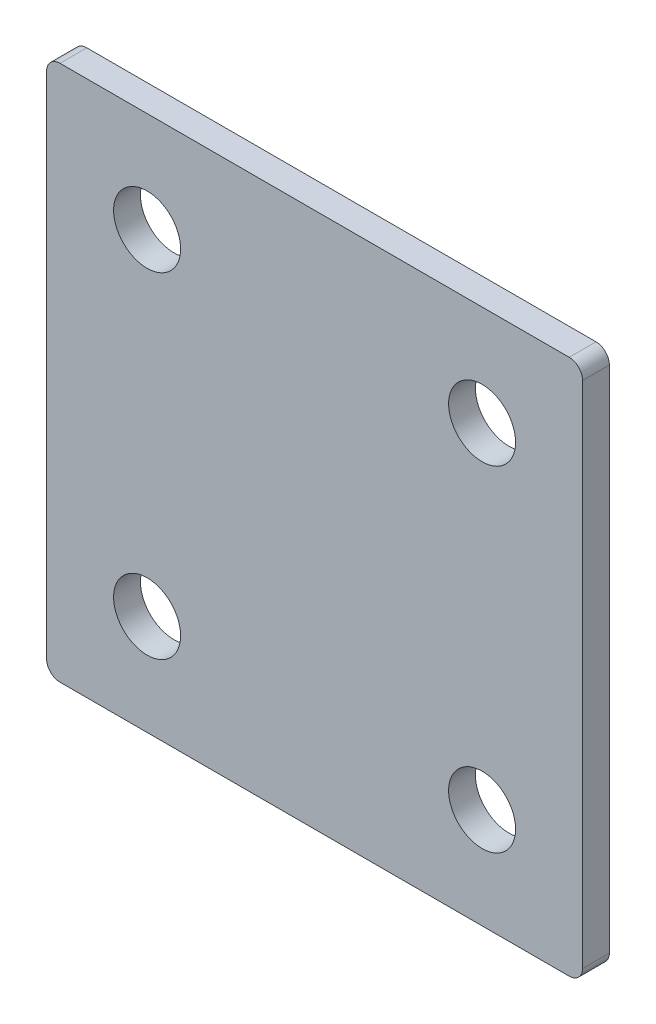
ISO-10303-21;
HEADER;
FILE_DESCRIPTION(('STEP AP214'),'2;1');
FILE_NAME('part.step','',(''),(''),'','','');
FILE_SCHEMA(('AUTOMOTIVE_DESIGN { 1 0 10303 214 1 1 1 1 }'));
ENDSEC;
DATA;
#1=APPLICATION_CONTEXT('core data for automotive mechanical design processes');
#2=APPLICATION_PROTOCOL_DEFINITION('international standard','automotive_design',2000,#1);
#3=PRODUCT_CONTEXT('',#1,'mechanical');
#4=PRODUCT('Part','Part','',(#3));
#5=PRODUCT_RELATED_PRODUCT_CATEGORY('part','',(#4));
#6=PRODUCT_DEFINITION_FORMATION('','',#4);
#7=PRODUCT_DEFINITION_CONTEXT('part definition',#1,'design');
#8=PRODUCT_DEFINITION('design','',#6,#7);
#9=PRODUCT_DEFINITION_SHAPE('','',#8);
#10=(LENGTH_UNIT() NAMED_UNIT(*) SI_UNIT(.MILLI.,.METRE.));
#11=(NAMED_UNIT(*) PLANE_ANGLE_UNIT() SI_UNIT($,.RADIAN.));
#12=(NAMED_UNIT(*) SI_UNIT($,.STERADIAN.) SOLID_ANGLE_UNIT());
#13=UNCERTAINTY_MEASURE_WITH_UNIT(LENGTH_MEASURE(1.E-05),#10,'distance_accuracy_value','');
#14=(GEOMETRIC_REPRESENTATION_CONTEXT(3) GLOBAL_UNCERTAINTY_ASSIGNED_CONTEXT((#13)) GLOBAL_UNIT_ASSIGNED_CONTEXT((#10,
#11,#12)) REPRESENTATION_CONTEXT('',''));
#15=CARTESIAN_POINT('',(0.,0.,0.));
#16=DIRECTION('',(0.,0.,1.));
#17=DIRECTION('',(1.,0.,0.));
#18=AXIS2_PLACEMENT_3D('',#15,#16,#17);
#19=CARTESIAN_POINT('',(515.343959720602,65.967618835388,16.7000000000001));
#20=DIRECTION('',(0.,0.,1.));
#21=DIRECTION('',(1.,0.,0.));
#22=AXIS2_PLACEMENT_3D('',#19,#20,#21);
#23=PLANE('',#22);
#24=CARTESIAN_POINT('',(578.343959753745,52.9676189960011,16.7000000000001));
#25=DIRECTION('',(0.,0.,1.));
#26=DIRECTION('',(1.,0.,0.));
#27=AXIS2_PLACEMENT_3D('',#24,#25,#26);
#28=CIRCLE('',#27,5.00000000000005);
#29=CARTESIAN_POINT('',(583.343959753745,52.9676189960011,16.7000000000001));
#30=VERTEX_POINT('',#29);
#31=EDGE_CURVE('E189',#30,#30,#28,.T.);
#32=ORIENTED_EDGE('',*,*,#31,.F.);
#33=EDGE_LOOP('',(#32));
#34=FACE_BOUND('',#33,.T.);
#35=CARTESIAN_POINT('',(528.343959881215,2.9676188685305,16.7000000000001));
#36=DIRECTION('',(0.,0.,1.));
#37=DIRECTION('',(1.,0.,0.));
#38=AXIS2_PLACEMENT_3D('',#35,#36,#37);
#39=CIRCLE('',#38,5.00000000000005);
#40=CARTESIAN_POINT('',(533.343959881215,2.9676188685305,16.7000000000001));
#41=VERTEX_POINT('',#40);
#42=EDGE_CURVE('E135',#41,#41,#39,.T.);
#43=ORIENTED_EDGE('',*,*,#42,.F.);
#44=EDGE_LOOP('',(#43));
#45=FACE_BOUND('',#44,.T.);
#46=CARTESIAN_POINT('',(515.343959720602,65.967618835388,16.7000000000001));
#47=DIRECTION('',(0.,0.,1.));
#48=DIRECTION('',(1.,0.,0.));
#49=AXIS2_PLACEMENT_3D('',#46,#47,#48);
#50=CIRCLE('',#49,2.);
#51=CARTESIAN_POINT('',(515.343959715504,67.967618835388,16.7000000000001));
#52=VERTEX_POINT('',#51);
#53=CARTESIAN_POINT('',(513.343959720602,65.9676188302892,16.7000000000001));
#54=VERTEX_POINT('',#53);
#55=EDGE_CURVE('E146',#52,#54,#50,.T.);
#56=ORIENTED_EDGE('',*,*,#55,.T.);
#57=DIRECTION('',(2.54941389636536E-09,-1.,0.));
#58=VECTOR('',#57,1.);
#59=CARTESIAN_POINT('',(513.343959720602,65.9676188302892,16.7000000000001));
#60=LINE('',#59,#58);
#61=CARTESIAN_POINT('',(513.343959914358,-10.0323811697108,16.7000000000001));
#62=VERTEX_POINT('',#61);
#63=EDGE_CURVE('E94',#54,#62,#60,.T.);
#64=ORIENTED_EDGE('',*,*,#63,.T.);
#65=CARTESIAN_POINT('',(515.343959914358,-10.032381164612,16.7000000000001));
#66=DIRECTION('',(0.,0.,1.));
#67=DIRECTION('',(1.,0.,0.));
#68=AXIS2_PLACEMENT_3D('',#65,#66,#67);
#69=CIRCLE('',#68,2.);
#70=CARTESIAN_POINT('',(515.343959919457,-12.032381164612,16.7000000000001));
#71=VERTEX_POINT('',#70);
#72=EDGE_CURVE('E161',#62,#71,#69,.T.);
#73=ORIENTED_EDGE('',*,*,#72,.T.);
#74=DIRECTION('',(1.,2.54941280075054E-09,0.));
#75=VECTOR('',#74,1.);
#76=CARTESIAN_POINT('',(515.343959919457,-12.032381164612,16.7000000000001));
#77=LINE('',#76,#75);
#78=CARTESIAN_POINT('',(591.343959919457,-12.0323809708566,16.7000000000001));
#79=VERTEX_POINT('',#78);
#80=EDGE_CURVE('E174',#71,#79,#77,.T.);
#81=ORIENTED_EDGE('',*,*,#80,.T.);
#82=CARTESIAN_POINT('',(591.343959914358,-10.0323809708566,16.7000000000001));
#83=DIRECTION('',(0.,0.,1.));
#84=DIRECTION('',(1.,0.,0.));
#85=AXIS2_PLACEMENT_3D('',#82,#83,#84);
#86=CIRCLE('',#85,2.);
#87=CARTESIAN_POINT('',(593.343959914358,-10.0323809657578,16.7000000000001));
#88=VERTEX_POINT('',#87);
#89=EDGE_CURVE('E113',#79,#88,#86,.T.);
#90=ORIENTED_EDGE('',*,*,#89,.T.);
#91=DIRECTION('',(-2.54941243554559E-09,1.,0.));
#92=VECTOR('',#91,1.);
#93=CARTESIAN_POINT('',(593.343959914358,-10.0323809657578,16.7000000000001));
#94=LINE('',#93,#92);
#95=CARTESIAN_POINT('',(593.343959720602,65.9676190342422,16.7000000000001));
#96=VERTEX_POINT('',#95);
#97=EDGE_CURVE('E107',#88,#96,#94,.T.);
#98=ORIENTED_EDGE('',*,*,#97,.T.);
#99=CARTESIAN_POINT('',(591.343959720602,65.9676190291434,16.7000000000001));
#100=DIRECTION('',(0.,0.,1.));
#101=DIRECTION('',(1.,0.,0.));
#102=AXIS2_PLACEMENT_3D('',#99,#100,#101);
#103=CIRCLE('',#102,2.);
#104=CARTESIAN_POINT('',(591.343959715504,67.9676190291434,16.7000000000001));
#105=VERTEX_POINT('',#104);
#106=EDGE_CURVE('E111',#96,#105,#103,.T.);
#107=ORIENTED_EDGE('',*,*,#106,.T.);
#108=DIRECTION('',(-1.,-2.54941280075053E-09,0.));
#109=VECTOR('',#108,1.);
#110=CARTESIAN_POINT('',(591.343959715504,67.9676190291434,16.7000000000001));
#111=LINE('',#110,#109);
#112=EDGE_CURVE('E51',#105,#52,#111,.T.);
#113=ORIENTED_EDGE('',*,*,#112,.T.);
#114=EDGE_LOOP('',(#56,#64,#73,#81,#90,#98,#107,#113));
#115=FACE_BOUND('',#114,.T.);
#116=CARTESIAN_POINT('',(578.343959881215,2.96761899600112,16.7000000000001));
#117=DIRECTION('',(0.,0.,1.));
#118=DIRECTION('',(1.,0.,0.));
#119=AXIS2_PLACEMENT_3D('',#116,#117,#118);
#120=CIRCLE('',#119,5.00000000000005);
#121=CARTESIAN_POINT('',(583.343959881215,2.96761899600112,16.7000000000001));
#122=VERTEX_POINT('',#121);
#123=EDGE_CURVE('E183',#122,#122,#120,.T.);
#124=ORIENTED_EDGE('',*,*,#123,.F.);
#125=EDGE_LOOP('',(#124));
#126=FACE_BOUND('',#125,.T.);
#127=CARTESIAN_POINT('',(528.343959753745,52.9676188685305,16.7000000000001));
#128=DIRECTION('',(0.,0.,1.));
#129=DIRECTION('',(1.,0.,0.));
#130=AXIS2_PLACEMENT_3D('',#127,#128,#129);
#131=CIRCLE('',#130,4.99999999999994);
#132=CARTESIAN_POINT('',(533.343959753744,52.9676188685305,16.7000000000001));
#133=VERTEX_POINT('',#132);
#134=EDGE_CURVE('E195',#133,#133,#131,.T.);
#135=ORIENTED_EDGE('',*,*,#134,.F.);
#136=EDGE_LOOP('',(#135));
#137=FACE_BOUND('',#136,.T.);
#138=ADVANCED_FACE('F34',(#34,#45,#115,#126,#137),#23,.T.);
#139=CARTESIAN_POINT('',(515.343959720602,65.967618835388,12.7000000000001));
#140=DIRECTION('',(0.,0.,1.));
#141=DIRECTION('',(1.,0.,0.));
#142=AXIS2_PLACEMENT_3D('',#139,#140,#141);
#143=PLANE('',#142);
#144=CARTESIAN_POINT('',(515.343959720602,65.967618835388,12.7000000000001));
#145=DIRECTION('',(0.,0.,1.));
#146=DIRECTION('',(1.,0.,0.));
#147=AXIS2_PLACEMENT_3D('',#144,#145,#146);
#148=CIRCLE('',#147,2.);
#149=CARTESIAN_POINT('',(515.343959715504,67.967618835388,12.7000000000001));
#150=VERTEX_POINT('',#149);
#151=CARTESIAN_POINT('',(513.343959720602,65.9676188302892,12.7000000000001));
#152=VERTEX_POINT('',#151);
#153=EDGE_CURVE('E131',#150,#152,#148,.T.);
#154=ORIENTED_EDGE('',*,*,#153,.F.);
#155=DIRECTION('',(-1.,-2.54941280075053E-09,0.));
#156=VECTOR('',#155,1.);
#157=CARTESIAN_POINT('',(591.343959715504,67.9676190291434,12.7000000000001));
#158=LINE('',#157,#156);
#159=CARTESIAN_POINT('',(591.343959715504,67.9676190291434,12.7000000000001));
#160=VERTEX_POINT('',#159);
#161=EDGE_CURVE('E86',#160,#150,#158,.T.);
#162=ORIENTED_EDGE('',*,*,#161,.F.);
#163=CARTESIAN_POINT('',(591.343959720602,65.9676190291434,12.7000000000001));
#164=DIRECTION('',(0.,0.,1.));
#165=DIRECTION('',(1.,0.,0.));
#166=AXIS2_PLACEMENT_3D('',#163,#164,#165);
#167=CIRCLE('',#166,2.);
#168=CARTESIAN_POINT('',(593.343959720602,65.9676190342422,12.7000000000001));
#169=VERTEX_POINT('',#168);
#170=EDGE_CURVE('E80',#169,#160,#167,.T.);
#171=ORIENTED_EDGE('',*,*,#170,.F.);
#172=DIRECTION('',(-2.54941243554559E-09,1.,0.));
#173=VECTOR('',#172,1.);
#174=CARTESIAN_POINT('',(593.343959914358,-10.0323809657578,12.7000000000001));
#175=LINE('',#174,#173);
#176=CARTESIAN_POINT('',(593.343959914358,-10.0323809657578,12.7000000000001));
#177=VERTEX_POINT('',#176);
#178=EDGE_CURVE('E121',#177,#169,#175,.T.);
#179=ORIENTED_EDGE('',*,*,#178,.F.);
#180=CARTESIAN_POINT('',(591.343959914358,-10.0323809708566,12.7000000000001));
#181=DIRECTION('',(0.,0.,1.));
#182=DIRECTION('',(1.,0.,0.));
#183=AXIS2_PLACEMENT_3D('',#180,#181,#182);
#184=CIRCLE('',#183,2.);
#185=CARTESIAN_POINT('',(591.343959919457,-12.0323809708566,12.7000000000001));
#186=VERTEX_POINT('',#185);
#187=EDGE_CURVE('E141',#186,#177,#184,.T.);
#188=ORIENTED_EDGE('',*,*,#187,.F.);
#189=DIRECTION('',(1.,2.54941280075054E-09,0.));
#190=VECTOR('',#189,1.);
#191=CARTESIAN_POINT('',(515.343959919457,-12.032381164612,12.7000000000001));
#192=LINE('',#191,#190);
#193=CARTESIAN_POINT('',(515.343959919457,-12.032381164612,12.7000000000001));
#194=VERTEX_POINT('',#193);
#195=EDGE_CURVE('E139',#194,#186,#192,.T.);
#196=ORIENTED_EDGE('',*,*,#195,.F.);
#197=CARTESIAN_POINT('',(515.343959914358,-10.032381164612,12.7000000000001));
#198=DIRECTION('',(0.,0.,1.));
#199=DIRECTION('',(1.,0.,0.));
#200=AXIS2_PLACEMENT_3D('',#197,#198,#199);
#201=CIRCLE('',#200,2.);
#202=CARTESIAN_POINT('',(513.343959914358,-10.0323811697108,12.7000000000001));
#203=VERTEX_POINT('',#202);
#204=EDGE_CURVE('E137',#203,#194,#201,.T.);
#205=ORIENTED_EDGE('',*,*,#204,.F.);
#206=DIRECTION('',(2.54941389636536E-09,-1.,0.));
#207=VECTOR('',#206,1.);
#208=CARTESIAN_POINT('',(513.343959720602,65.9676188302892,12.7000000000001));
#209=LINE('',#208,#207);
#210=EDGE_CURVE('E134',#152,#203,#209,.T.);
#211=ORIENTED_EDGE('',*,*,#210,.F.);
#212=EDGE_LOOP('',(#154,#162,#171,#179,#188,#196,#205,#211));
#213=FACE_BOUND('',#212,.T.);
#214=CARTESIAN_POINT('',(528.343959881215,2.9676188685305,12.7000000000001));
#215=DIRECTION('',(0.,0.,1.));
#216=DIRECTION('',(1.,0.,0.));
#217=AXIS2_PLACEMENT_3D('',#214,#215,#216);
#218=CIRCLE('',#217,5.00000000000005);
#219=CARTESIAN_POINT('',(533.343959881215,2.9676188685305,12.7000000000001));
#220=VERTEX_POINT('',#219);
#221=EDGE_CURVE('E180',#220,#220,#218,.T.);
#222=ORIENTED_EDGE('',*,*,#221,.T.);
#223=EDGE_LOOP('',(#222));
#224=FACE_BOUND('',#223,.T.);
#225=CARTESIAN_POINT('',(578.343959881215,2.96761899600112,12.7000000000001));
#226=DIRECTION('',(0.,0.,1.));
#227=DIRECTION('',(1.,0.,0.));
#228=AXIS2_PLACEMENT_3D('',#225,#226,#227);
#229=CIRCLE('',#228,5.00000000000005);
#230=CARTESIAN_POINT('',(583.343959881215,2.96761899600112,12.7000000000001));
#231=VERTEX_POINT('',#230);
#232=EDGE_CURVE('E186',#231,#231,#229,.T.);
#233=ORIENTED_EDGE('',*,*,#232,.T.);
#234=EDGE_LOOP('',(#233));
#235=FACE_BOUND('',#234,.T.);
#236=CARTESIAN_POINT('',(578.343959753745,52.9676189960011,12.7000000000001));
#237=DIRECTION('',(0.,0.,1.));
#238=DIRECTION('',(1.,0.,0.));
#239=AXIS2_PLACEMENT_3D('',#236,#237,#238);
#240=CIRCLE('',#239,5.00000000000005);
#241=CARTESIAN_POINT('',(583.343959753745,52.9676189960011,12.7000000000001));
#242=VERTEX_POINT('',#241);
#243=EDGE_CURVE('E192',#242,#242,#240,.T.);
#244=ORIENTED_EDGE('',*,*,#243,.T.);
#245=EDGE_LOOP('',(#244));
#246=FACE_BOUND('',#245,.T.);
#247=CARTESIAN_POINT('',(528.343959753745,52.9676188685305,12.7000000000001));
#248=DIRECTION('',(0.,0.,1.));
#249=DIRECTION('',(1.,0.,0.));
#250=AXIS2_PLACEMENT_3D('',#247,#248,#249);
#251=CIRCLE('',#250,4.99999999999994);
#252=CARTESIAN_POINT('',(533.343959753744,52.9676188685305,12.7000000000001));
#253=VERTEX_POINT('',#252);
#254=EDGE_CURVE('E198',#253,#253,#251,.T.);
#255=ORIENTED_EDGE('',*,*,#254,.T.);
#256=EDGE_LOOP('',(#255));
#257=FACE_BOUND('',#256,.T.);
#258=ADVANCED_FACE('F165',(#213,#224,#235,#246,#257),#143,.F.);
#259=CARTESIAN_POINT('',(515.343959720602,65.967618835388,16.7000000000001));
#260=DIRECTION('',(0.,0.,-1.));
#261=DIRECTION('',(-1.,0.,0.));
#262=AXIS2_PLACEMENT_3D('',#259,#260,#261);
#263=CYLINDRICAL_SURFACE('',#262,2.);
#264=ORIENTED_EDGE('',*,*,#153,.T.);
#265=DIRECTION('',(0.,0.,-1.));
#266=VECTOR('',#265,1.);
#267=CARTESIAN_POINT('',(513.343959720602,65.9676188302892,16.7000000000001));
#268=LINE('',#267,#266);
#269=EDGE_CURVE('E11',#54,#152,#268,.T.);
#270=ORIENTED_EDGE('',*,*,#269,.F.);
#271=ORIENTED_EDGE('',*,*,#55,.F.);
#272=DIRECTION('',(0.,0.,-1.));
#273=VECTOR('',#272,1.);
#274=CARTESIAN_POINT('',(515.343959715504,67.967618835388,16.7000000000001));
#275=LINE('',#274,#273);
#276=EDGE_CURVE('E127',#52,#150,#275,.T.);
#277=ORIENTED_EDGE('',*,*,#276,.T.);
#278=EDGE_LOOP('',(#264,#270,#271,#277));
#279=FACE_BOUND('',#278,.T.);
#280=ADVANCED_FACE('F36',(#279),#263,.T.);
#281=CARTESIAN_POINT('',(513.343959720602,65.9676188302892,16.7000000000001));
#282=DIRECTION('',(1.,2.54941389636536E-09,0.));
#283=DIRECTION('',(-2.54941389636536E-09,1.,0.));
#284=AXIS2_PLACEMENT_3D('',#281,#282,#283);
#285=PLANE('',#284);
#286=ORIENTED_EDGE('',*,*,#210,.T.);
#287=DIRECTION('',(0.,0.,-1.));
#288=VECTOR('',#287,1.);
#289=CARTESIAN_POINT('',(513.343959914358,-10.0323811697108,16.7000000000001));
#290=LINE('',#289,#288);
#291=EDGE_CURVE('E43',#62,#203,#290,.T.);
#292=ORIENTED_EDGE('',*,*,#291,.F.);
#293=ORIENTED_EDGE('',*,*,#63,.F.);
#294=ORIENTED_EDGE('',*,*,#269,.T.);
#295=EDGE_LOOP('',(#286,#292,#293,#294));
#296=FACE_BOUND('',#295,.T.);
#297=ADVANCED_FACE('F232',(#296),#285,.F.);
#298=CARTESIAN_POINT('',(515.343959914358,-10.032381164612,16.7000000000001));
#299=DIRECTION('',(0.,0.,-1.));
#300=DIRECTION('',(-1.,0.,0.));
#301=AXIS2_PLACEMENT_3D('',#298,#299,#300);
#302=CYLINDRICAL_SURFACE('',#301,2.);
#303=ORIENTED_EDGE('',*,*,#204,.T.);
#304=DIRECTION('',(0.,0.,-1.));
#305=VECTOR('',#304,1.);
#306=CARTESIAN_POINT('',(515.343959919457,-12.032381164612,16.7000000000001));
#307=LINE('',#306,#305);
#308=EDGE_CURVE('E153',#71,#194,#307,.T.);
#309=ORIENTED_EDGE('',*,*,#308,.F.);
#310=ORIENTED_EDGE('',*,*,#72,.F.);
#311=ORIENTED_EDGE('',*,*,#291,.T.);
#312=EDGE_LOOP('',(#303,#309,#310,#311));
#313=FACE_BOUND('',#312,.T.);
#314=ADVANCED_FACE('F159',(#313),#302,.T.);
#315=CARTESIAN_POINT('',(515.343959919457,-12.032381164612,16.7000000000001));
#316=DIRECTION('',(-2.54941280075054E-09,1.,0.));
#317=DIRECTION('',(-1.,-2.54941280075054E-09,0.));
#318=AXIS2_PLACEMENT_3D('',#315,#316,#317);
#319=PLANE('',#318);
#320=ORIENTED_EDGE('',*,*,#195,.T.);
#321=DIRECTION('',(0.,0.,-1.));
#322=VECTOR('',#321,1.);
#323=CARTESIAN_POINT('',(591.343959919457,-12.0323809708566,16.7000000000001));
#324=LINE('',#323,#322);
#325=EDGE_CURVE('E150',#79,#186,#324,.T.);
#326=ORIENTED_EDGE('',*,*,#325,.F.);
#327=ORIENTED_EDGE('',*,*,#80,.F.);
#328=ORIENTED_EDGE('',*,*,#308,.T.);
#329=EDGE_LOOP('',(#320,#326,#327,#328));
#330=FACE_BOUND('',#329,.T.);
#331=ADVANCED_FACE('F170',(#330),#319,.F.);
#332=CARTESIAN_POINT('',(591.343959914358,-10.0323809708566,16.7000000000001));
#333=DIRECTION('',(0.,0.,-1.));
#334=DIRECTION('',(-1.,0.,0.));
#335=AXIS2_PLACEMENT_3D('',#332,#333,#334);
#336=CYLINDRICAL_SURFACE('',#335,2.);
#337=ORIENTED_EDGE('',*,*,#187,.T.);
#338=DIRECTION('',(0.,0.,-1.));
#339=VECTOR('',#338,1.);
#340=CARTESIAN_POINT('',(593.343959914358,-10.0323809657578,16.7000000000001));
#341=LINE('',#340,#339);
#342=EDGE_CURVE('E122',#88,#177,#341,.T.);
#343=ORIENTED_EDGE('',*,*,#342,.F.);
#344=ORIENTED_EDGE('',*,*,#89,.F.);
#345=ORIENTED_EDGE('',*,*,#325,.T.);
#346=EDGE_LOOP('',(#337,#343,#344,#345));
#347=FACE_BOUND('',#346,.T.);
#348=ADVANCED_FACE('F173',(#347),#336,.T.);
#349=CARTESIAN_POINT('',(593.343959914358,-10.0323809657578,16.7000000000001));
#350=DIRECTION('',(-1.,-2.54941243554559E-09,0.));
#351=DIRECTION('',(2.54941243554559E-09,-1.,0.));
#352=AXIS2_PLACEMENT_3D('',#349,#350,#351);
#353=PLANE('',#352);
#354=ORIENTED_EDGE('',*,*,#178,.T.);
#355=DIRECTION('',(0.,0.,-1.));
#356=VECTOR('',#355,1.);
#357=CARTESIAN_POINT('',(593.343959720602,65.9676190342422,16.7000000000001));
#358=LINE('',#357,#356);
#359=EDGE_CURVE('E118',#96,#169,#358,.T.);
#360=ORIENTED_EDGE('',*,*,#359,.F.);
#361=ORIENTED_EDGE('',*,*,#97,.F.);
#362=ORIENTED_EDGE('',*,*,#342,.T.);
#363=EDGE_LOOP('',(#354,#360,#361,#362));
#364=FACE_BOUND('',#363,.T.);
#365=ADVANCED_FACE('F119',(#364),#353,.F.);
#366=CARTESIAN_POINT('',(591.343959720602,65.9676190291434,16.7000000000001));
#367=DIRECTION('',(0.,0.,-1.));
#368=DIRECTION('',(-1.,0.,0.));
#369=AXIS2_PLACEMENT_3D('',#366,#367,#368);
#370=CYLINDRICAL_SURFACE('',#369,2.);
#371=ORIENTED_EDGE('',*,*,#170,.T.);
#372=DIRECTION('',(0.,0.,-1.));
#373=VECTOR('',#372,1.);
#374=CARTESIAN_POINT('',(591.343959715504,67.9676190291434,16.7000000000001));
#375=LINE('',#374,#373);
#376=EDGE_CURVE('E123',#105,#160,#375,.T.);
#377=ORIENTED_EDGE('',*,*,#376,.F.);
#378=ORIENTED_EDGE('',*,*,#106,.F.);
#379=ORIENTED_EDGE('',*,*,#359,.T.);
#380=EDGE_LOOP('',(#371,#377,#378,#379));
#381=FACE_BOUND('',#380,.T.);
#382=ADVANCED_FACE('F125',(#381),#370,.T.);
#383=CARTESIAN_POINT('',(591.343959715504,67.9676190291434,16.7000000000001));
#384=DIRECTION('',(2.54941280075053E-09,-1.,0.));
#385=DIRECTION('',(1.,2.54941280075053E-09,0.));
#386=AXIS2_PLACEMENT_3D('',#383,#384,#385);
#387=PLANE('',#386);
#388=ORIENTED_EDGE('',*,*,#161,.T.);
#389=ORIENTED_EDGE('',*,*,#276,.F.);
#390=ORIENTED_EDGE('',*,*,#112,.F.);
#391=ORIENTED_EDGE('',*,*,#376,.T.);
#392=EDGE_LOOP('',(#388,#389,#390,#391));
#393=FACE_BOUND('',#392,.T.);
#394=ADVANCED_FACE('F220',(#393),#387,.F.);
#395=CARTESIAN_POINT('',(528.343959881215,2.9676188685305,16.7000000000001));
#396=DIRECTION('',(0.,0.,-1.));
#397=DIRECTION('',(-1.,0.,0.));
#398=AXIS2_PLACEMENT_3D('',#395,#396,#397);
#399=CYLINDRICAL_SURFACE('',#398,5.00000000000005);
#400=ORIENTED_EDGE('',*,*,#42,.T.);
#401=EDGE_LOOP('',(#400));
#402=FACE_BOUND('',#401,.T.);
#403=ORIENTED_EDGE('',*,*,#221,.F.);
#404=EDGE_LOOP('',(#403));
#405=FACE_BOUND('',#404,.T.);
#406=ADVANCED_FACE('F217',(#402,#405),#399,.F.);
#407=CARTESIAN_POINT('',(578.343959881215,2.96761899600112,16.7000000000001));
#408=DIRECTION('',(0.,0.,-1.));
#409=DIRECTION('',(-1.,0.,0.));
#410=AXIS2_PLACEMENT_3D('',#407,#408,#409);
#411=CYLINDRICAL_SURFACE('',#410,5.00000000000005);
#412=ORIENTED_EDGE('',*,*,#123,.T.);
#413=EDGE_LOOP('',(#412));
#414=FACE_BOUND('',#413,.T.);
#415=ORIENTED_EDGE('',*,*,#232,.F.);
#416=EDGE_LOOP('',(#415));
#417=FACE_BOUND('',#416,.T.);
#418=ADVANCED_FACE('F295',(#414,#417),#411,.F.);
#419=CARTESIAN_POINT('',(578.343959753745,52.9676189960011,16.7000000000001));
#420=DIRECTION('',(0.,0.,-1.));
#421=DIRECTION('',(-1.,0.,0.));
#422=AXIS2_PLACEMENT_3D('',#419,#420,#421);
#423=CYLINDRICAL_SURFACE('',#422,5.00000000000005);
#424=ORIENTED_EDGE('',*,*,#31,.T.);
#425=EDGE_LOOP('',(#424));
#426=FACE_BOUND('',#425,.T.);
#427=ORIENTED_EDGE('',*,*,#243,.F.);
#428=EDGE_LOOP('',(#427));
#429=FACE_BOUND('',#428,.T.);
#430=ADVANCED_FACE('F303',(#426,#429),#423,.F.);
#431=CARTESIAN_POINT('',(528.343959753745,52.9676188685305,16.7000000000001));
#432=DIRECTION('',(0.,0.,-1.));
#433=DIRECTION('',(-1.,0.,0.));
#434=AXIS2_PLACEMENT_3D('',#431,#432,#433);
#435=CYLINDRICAL_SURFACE('',#434,4.99999999999994);
#436=ORIENTED_EDGE('',*,*,#134,.T.);
#437=EDGE_LOOP('',(#436));
#438=FACE_BOUND('',#437,.T.);
#439=ORIENTED_EDGE('',*,*,#254,.F.);
#440=EDGE_LOOP('',(#439));
#441=FACE_BOUND('',#440,.T.);
#442=ADVANCED_FACE('F204',(#438,#441),#435,.F.);
#443=CLOSED_SHELL('',(#138,#258,#280,#297,#314,#331,#348,#365,#382,#394,#406,#418,#430,#442));
#444=MANIFOLD_SOLID_BREP('B2',#443);
#445=ADVANCED_BREP_SHAPE_REPRESENTATION('',(#18,#444),#14);
#446=SHAPE_DEFINITION_REPRESENTATION(#9,#445);
ENDSEC;
END-ISO-10303-21;
